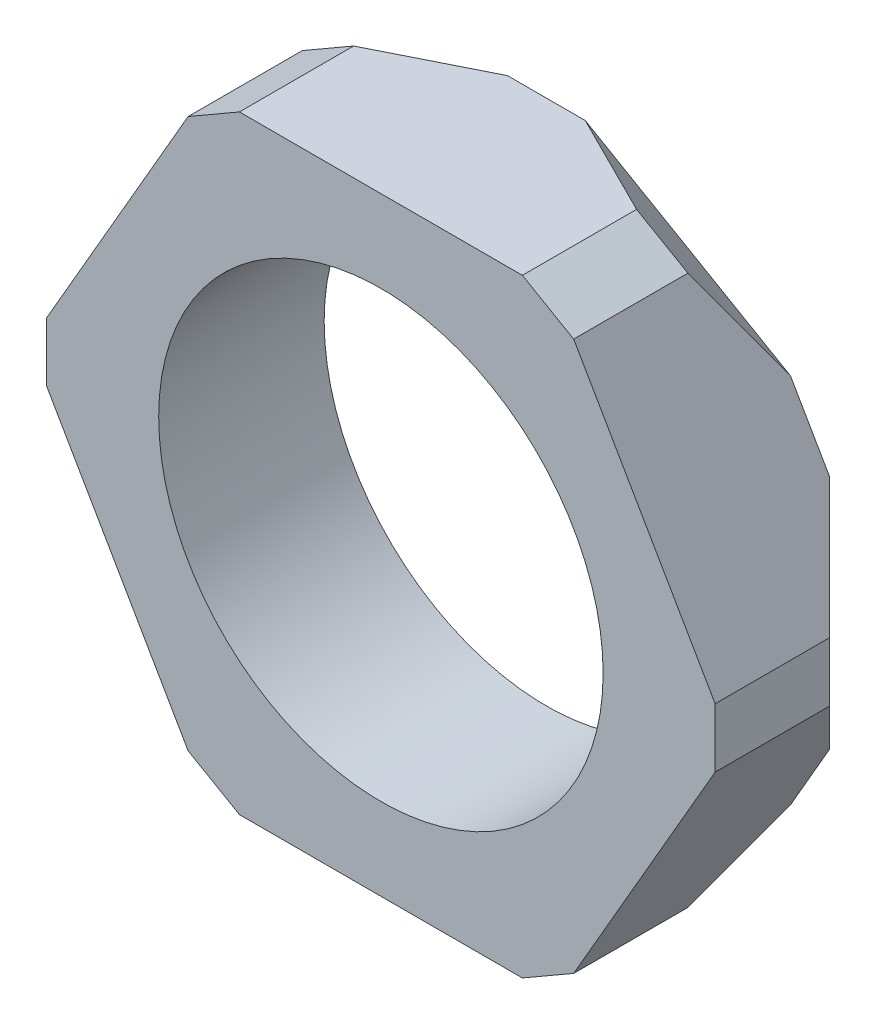
ISO-10303-21;
HEADER;
FILE_DESCRIPTION(('STEP AP214'),'2;1');
FILE_NAME('part.step','',(''),(''),'','','');
FILE_SCHEMA(('AUTOMOTIVE_DESIGN { 1 0 10303 214 1 1 1 1 }'));
ENDSEC;
DATA;
#1=APPLICATION_CONTEXT('core data for automotive mechanical design processes');
#2=APPLICATION_PROTOCOL_DEFINITION('international standard','automotive_design',2000,#1);
#3=PRODUCT_CONTEXT('',#1,'mechanical');
#4=PRODUCT('Part','Part','',(#3));
#5=PRODUCT_RELATED_PRODUCT_CATEGORY('part','',(#4));
#6=PRODUCT_DEFINITION_FORMATION('','',#4);
#7=PRODUCT_DEFINITION_CONTEXT('part definition',#1,'design');
#8=PRODUCT_DEFINITION('design','',#6,#7);
#9=PRODUCT_DEFINITION_SHAPE('','',#8);
#10=(LENGTH_UNIT() NAMED_UNIT(*) SI_UNIT(.MILLI.,.METRE.));
#11=(NAMED_UNIT(*) PLANE_ANGLE_UNIT() SI_UNIT($,.RADIAN.));
#12=(NAMED_UNIT(*) SI_UNIT($,.STERADIAN.) SOLID_ANGLE_UNIT());
#13=UNCERTAINTY_MEASURE_WITH_UNIT(LENGTH_MEASURE(1.E-05),#10,'distance_accuracy_value','');
#14=(GEOMETRIC_REPRESENTATION_CONTEXT(3) GLOBAL_UNCERTAINTY_ASSIGNED_CONTEXT((#13)) GLOBAL_UNIT_ASSIGNED_CONTEXT((#10,
#11,#12)) REPRESENTATION_CONTEXT('',''));
#15=CARTESIAN_POINT('',(0.,0.,0.));
#16=DIRECTION('',(0.,0.,1.));
#17=DIRECTION('',(1.,0.,0.));
#18=AXIS2_PLACEMENT_3D('',#15,#16,#17);
#19=CARTESIAN_POINT('',(0.,0.,4.84));
#20=DIRECTION('',(0.,0.,1.));
#21=DIRECTION('',(1.,0.,0.));
#22=AXIS2_PLACEMENT_3D('',#19,#20,#21);
#23=PLANE('',#22);
#24=DIRECTION('',(1.,0.,0.));
#25=VECTOR('',#24,1.);
#26=CARTESIAN_POINT('',(-5.13841739578752,-8.90000000000013,4.84));
#27=LINE('',#26,#25);
#28=CARTESIAN_POINT('',(-4.1384173957875,-8.90000000000013,4.84));
#29=VERTEX_POINT('',#28);
#30=CARTESIAN_POINT('',(4.13841739578773,-8.90000000000013,4.84));
#31=VERTEX_POINT('',#30);
#32=EDGE_CURVE('E169',#29,#31,#27,.T.);
#33=ORIENTED_EDGE('',*,*,#32,.T.);
#34=DIRECTION('',(-0.866025403784438,-0.5,0.));
#35=VECTOR('',#34,1.);
#36=CARTESIAN_POINT('',(4.88841739578774,-8.46698729810791,4.84));
#37=LINE('',#36,#35);
#38=CARTESIAN_POINT('',(5.63841739578775,-8.03397459621568,4.84));
#39=VERTEX_POINT('',#38);
#40=EDGE_CURVE('E163',#31,#39,#37,.F.);
#41=ORIENTED_EDGE('',*,*,#40,.T.);
#42=DIRECTION('',(0.499999999999999,0.866025403784439,0.));
#43=VECTOR('',#42,1.);
#44=CARTESIAN_POINT('',(5.13841739578774,-8.90000000000013,4.84));
#45=LINE('',#44,#43);
#46=CARTESIAN_POINT('',(9.77683479157543,-0.866025403784524,4.84));
#47=VERTEX_POINT('',#46);
#48=EDGE_CURVE('E166',#39,#47,#45,.T.);
#49=ORIENTED_EDGE('',*,*,#48,.T.);
#50=DIRECTION('',(0.,-1.,0.));
#51=VECTOR('',#50,1.);
#52=CARTESIAN_POINT('',(9.77683479157542,0.,4.84));
#53=LINE('',#52,#51);
#54=CARTESIAN_POINT('',(9.77683479157542,0.866025403784365,4.84));
#55=VERTEX_POINT('',#54);
#56=EDGE_CURVE('E197',#47,#55,#53,.F.);
#57=ORIENTED_EDGE('',*,*,#56,.T.);
#58=DIRECTION('',(-0.5,0.866025403784438,0.));
#59=VECTOR('',#58,1.);
#60=CARTESIAN_POINT('',(10.2768347915754,0.,4.84));
#61=LINE('',#60,#59);
#62=CARTESIAN_POINT('',(5.63841739578772,8.03397459621554,4.84));
#63=VERTEX_POINT('',#62);
#64=EDGE_CURVE('E290',#55,#63,#61,.T.);
#65=ORIENTED_EDGE('',*,*,#64,.T.);
#66=DIRECTION('',(0.866025403784439,-0.5,0.));
#67=VECTOR('',#66,1.);
#68=CARTESIAN_POINT('',(4.88841739578767,8.46698729810779,4.84));
#69=LINE('',#68,#67);
#70=CARTESIAN_POINT('',(4.1384173957877,8.89999999999999,4.84));
#71=VERTEX_POINT('',#70);
#72=EDGE_CURVE('E195',#63,#71,#69,.F.);
#73=ORIENTED_EDGE('',*,*,#72,.T.);
#74=DIRECTION('',(-1.,0.,0.));
#75=VECTOR('',#74,1.);
#76=CARTESIAN_POINT('',(5.13841739578771,8.89999999999999,4.84));
#77=LINE('',#76,#75);
#78=CARTESIAN_POINT('',(-4.13841739578749,8.89999999999999,4.84));
#79=VERTEX_POINT('',#78);
#80=EDGE_CURVE('E292',#71,#79,#77,.T.);
#81=ORIENTED_EDGE('',*,*,#80,.T.);
#82=DIRECTION('',(0.866025403784438,0.500000000000001,0.));
#83=VECTOR('',#82,1.);
#84=CARTESIAN_POINT('',(-4.88841739578762,8.46698729810769,4.84));
#85=LINE('',#84,#83);
#86=CARTESIAN_POINT('',(-5.63841739578749,8.03397459621555,4.84));
#87=VERTEX_POINT('',#86);
#88=EDGE_CURVE('E199',#79,#87,#85,.F.);
#89=ORIENTED_EDGE('',*,*,#88,.T.);
#90=DIRECTION('',(-0.499999999999997,-0.86602540378444,0.));
#91=VECTOR('',#90,1.);
#92=CARTESIAN_POINT('',(-5.13841739578749,8.89999999999999,4.84));
#93=LINE('',#92,#91);
#94=CARTESIAN_POINT('',(-9.77683479157515,0.866025403784389,4.84));
#95=VERTEX_POINT('',#94);
#96=EDGE_CURVE('E295',#87,#95,#93,.T.);
#97=ORIENTED_EDGE('',*,*,#96,.T.);
#98=DIRECTION('',(0.,1.,0.));
#99=VECTOR('',#98,1.);
#100=CARTESIAN_POINT('',(-9.77683479157515,0.,4.84));
#101=LINE('',#100,#99);
#102=CARTESIAN_POINT('',(-9.77683479157515,-0.866025403784505,4.84));
#103=VERTEX_POINT('',#102);
#104=EDGE_CURVE('E201',#95,#103,#101,.F.);
#105=ORIENTED_EDGE('',*,*,#104,.T.);
#106=DIRECTION('',(0.499999999999994,-0.866025403784442,0.));
#107=VECTOR('',#106,1.);
#108=CARTESIAN_POINT('',(-10.2768347915752,0.,4.84));
#109=LINE('',#108,#107);
#110=CARTESIAN_POINT('',(-5.63841739578752,-8.03397459621568,4.84));
#111=VERTEX_POINT('',#110);
#112=EDGE_CURVE('E304',#103,#111,#109,.T.);
#113=ORIENTED_EDGE('',*,*,#112,.T.);
#114=DIRECTION('',(-0.866025403784438,0.500000000000002,0.));
#115=VECTOR('',#114,1.);
#116=CARTESIAN_POINT('',(-4.8884173957877,-8.4669872981078,4.84));
#117=LINE('',#116,#115);
#118=EDGE_CURVE('E174',#111,#29,#117,.F.);
#119=ORIENTED_EDGE('',*,*,#118,.T.);
#120=EDGE_LOOP('',(#33,#41,#49,#57,#65,#73,#81,#89,#97,#105,#113,#119));
#121=FACE_BOUND('',#120,.T.);
#122=CARTESIAN_POINT('',(0.,0.,4.84));
#123=DIRECTION('',(0.,0.,1.));
#124=DIRECTION('',(1.,0.,0.));
#125=AXIS2_PLACEMENT_3D('',#122,#123,#124);
#126=CIRCLE('',#125,6.50000000000001);
#127=CARTESIAN_POINT('',(6.50000000000001,0.,4.84));
#128=VERTEX_POINT('',#127);
#129=EDGE_CURVE('E284',#128,#128,#126,.T.);
#130=ORIENTED_EDGE('',*,*,#129,.F.);
#131=EDGE_LOOP('',(#130));
#132=FACE_BOUND('',#131,.T.);
#133=ADVANCED_FACE('F35',(#121,#132),#23,.T.);
#134=CARTESIAN_POINT('',(0.,0.,0.));
#135=DIRECTION('',(0.,0.,1.));
#136=DIRECTION('',(1.,0.,0.));
#137=AXIS2_PLACEMENT_3D('',#134,#135,#136);
#138=PLANE('',#137);
#139=DIRECTION('',(-0.499999999999997,-0.86602540378444,0.));
#140=VECTOR('',#139,1.);
#141=CARTESIAN_POINT('',(-5.13841739578749,8.89999999999999,0.));
#142=LINE('',#141,#140);
#143=CARTESIAN_POINT('',(-7.13841739578748,5.43589838486224,0.));
#144=VERTEX_POINT('',#143);
#145=CARTESIAN_POINT('',(-8.27683479157514,3.46410161513773,0.));
#146=VERTEX_POINT('',#145);
#147=EDGE_CURVE('E310',#144,#146,#142,.T.);
#148=ORIENTED_EDGE('',*,*,#147,.F.);
#149=DIRECTION('',(0.866025403784438,0.500000000000001,0.));
#150=VECTOR('',#149,1.);
#151=CARTESIAN_POINT('',(-3.38841739578749,7.60096189432333,0.));
#152=LINE('',#151,#150);
#153=CARTESIAN_POINT('',(-1.13841739578749,8.89999999999999,0.));
#154=VERTEX_POINT('',#153);
#155=EDGE_CURVE('E237',#144,#154,#152,.T.);
#156=ORIENTED_EDGE('',*,*,#155,.T.);
#157=DIRECTION('',(-1.,0.,0.));
#158=VECTOR('',#157,1.);
#159=CARTESIAN_POINT('',(5.13841739578771,8.89999999999999,0.));
#160=LINE('',#159,#158);
#161=CARTESIAN_POINT('',(1.13841739578771,8.89999999999999,0.));
#162=VERTEX_POINT('',#161);
#163=EDGE_CURVE('E283',#162,#154,#160,.T.);
#164=ORIENTED_EDGE('',*,*,#163,.F.);
#165=DIRECTION('',(0.866025403784439,-0.5,0.));
#166=VECTOR('',#165,1.);
#167=CARTESIAN_POINT('',(4.88841739578772,6.73493649053889,0.));
#168=LINE('',#167,#166);
#169=CARTESIAN_POINT('',(7.13841739578772,5.43589838486223,0.));
#170=VERTEX_POINT('',#169);
#171=EDGE_CURVE('E222',#162,#170,#168,.T.);
#172=ORIENTED_EDGE('',*,*,#171,.T.);
#173=DIRECTION('',(-0.5,0.866025403784438,0.));
#174=VECTOR('',#173,1.);
#175=CARTESIAN_POINT('',(10.2768347915754,0.,0.));
#176=LINE('',#175,#174);
#177=CARTESIAN_POINT('',(8.27683479157542,3.46410161513768,0.));
#178=VERTEX_POINT('',#177);
#179=EDGE_CURVE('E271',#178,#170,#176,.T.);
#180=ORIENTED_EDGE('',*,*,#179,.F.);
#181=DIRECTION('',(0.,-1.,0.));
#182=VECTOR('',#181,1.);
#183=CARTESIAN_POINT('',(8.27683479157543,-0.866025403784526,0.));
#184=LINE('',#183,#182);
#185=CARTESIAN_POINT('',(8.27683479157543,-3.46410161513784,0.));
#186=VERTEX_POINT('',#185);
#187=EDGE_CURVE('E225',#178,#186,#184,.T.);
#188=ORIENTED_EDGE('',*,*,#187,.T.);
#189=DIRECTION('',(0.499999999999999,0.866025403784439,0.));
#190=VECTOR('',#189,1.);
#191=CARTESIAN_POINT('',(5.13841739578774,-8.90000000000013,0.));
#192=LINE('',#191,#190);
#193=CARTESIAN_POINT('',(7.13841739578774,-5.43589838486237,0.));
#194=VERTEX_POINT('',#193);
#195=EDGE_CURVE('E287',#194,#186,#192,.T.);
#196=ORIENTED_EDGE('',*,*,#195,.F.);
#197=DIRECTION('',(-0.866025403784439,-0.5,0.));
#198=VECTOR('',#197,1.);
#199=CARTESIAN_POINT('',(3.38841739578773,-7.60096189432347,0.));
#200=LINE('',#199,#198);
#201=CARTESIAN_POINT('',(1.13841739578773,-8.90000000000013,0.));
#202=VERTEX_POINT('',#201);
#203=EDGE_CURVE('E228',#194,#202,#200,.T.);
#204=ORIENTED_EDGE('',*,*,#203,.T.);
#205=DIRECTION('',(1.,0.,0.));
#206=VECTOR('',#205,1.);
#207=CARTESIAN_POINT('',(-5.13841739578752,-8.90000000000013,0.));
#208=LINE('',#207,#206);
#209=CARTESIAN_POINT('',(-1.13841739578751,-8.90000000000013,0.));
#210=VERTEX_POINT('',#209);
#211=EDGE_CURVE('E297',#210,#202,#208,.T.);
#212=ORIENTED_EDGE('',*,*,#211,.F.);
#213=DIRECTION('',(-0.866025403784438,0.500000000000002,0.));
#214=VECTOR('',#213,1.);
#215=CARTESIAN_POINT('',(-4.88841739578752,-6.73493649053902,0.));
#216=LINE('',#215,#214);
#217=CARTESIAN_POINT('',(-7.13841739578749,-5.43589838486237,0.));
#218=VERTEX_POINT('',#217);
#219=EDGE_CURVE('E231',#210,#218,#216,.T.);
#220=ORIENTED_EDGE('',*,*,#219,.T.);
#221=DIRECTION('',(0.499999999999994,-0.866025403784442,0.));
#222=VECTOR('',#221,1.);
#223=CARTESIAN_POINT('',(-10.2768347915752,0.,0.));
#224=LINE('',#223,#222);
#225=CARTESIAN_POINT('',(-8.27683479157517,-3.46410161513784,0.));
#226=VERTEX_POINT('',#225);
#227=EDGE_CURVE('E313',#226,#218,#224,.T.);
#228=ORIENTED_EDGE('',*,*,#227,.F.);
#229=DIRECTION('',(0.,1.,0.));
#230=VECTOR('',#229,1.);
#231=CARTESIAN_POINT('',(-8.27683479157515,0.866025403784385,0.));
#232=LINE('',#231,#230);
#233=EDGE_CURVE('E234',#226,#146,#232,.T.);
#234=ORIENTED_EDGE('',*,*,#233,.T.);
#235=EDGE_LOOP('',(#148,#156,#164,#172,#180,#188,#196,#204,#212,#220,#228,#234));
#236=FACE_BOUND('',#235,.T.);
#237=CARTESIAN_POINT('',(0.,0.,0.));
#238=DIRECTION('',(0.,0.,1.));
#239=DIRECTION('',(1.,0.,0.));
#240=AXIS2_PLACEMENT_3D('',#237,#238,#239);
#241=CIRCLE('',#240,6.50000000000001);
#242=CARTESIAN_POINT('',(6.50000000000001,0.,0.));
#243=VERTEX_POINT('',#242);
#244=EDGE_CURVE('E299',#243,#243,#241,.T.);
#245=ORIENTED_EDGE('',*,*,#244,.T.);
#246=EDGE_LOOP('',(#245));
#247=FACE_BOUND('',#246,.T.);
#248=ADVANCED_FACE('F277',(#236,#247),#138,.F.);
#249=CARTESIAN_POINT('',(10.2768347915754,0.,4.84));
#250=DIRECTION('',(-0.866025403784438,-0.5,0.));
#251=DIRECTION('',(0.5,-0.866025403784439,0.));
#252=AXIS2_PLACEMENT_3D('',#249,#250,#251);
#253=PLANE('',#252);
#254=DIRECTION('',(0.,0.,-1.));
#255=VECTOR('',#254,1.);
#256=CARTESIAN_POINT('',(9.77683479157542,0.866025403784366,4.84));
#257=LINE('',#256,#255);
#258=CARTESIAN_POINT('',(9.77683479157542,0.866025403784366,1.5));
#259=VERTEX_POINT('',#258);
#260=EDGE_CURVE('E220',#55,#259,#257,.T.);
#261=ORIENTED_EDGE('',*,*,#260,.T.);
#262=DIRECTION('',(0.447213595499958,-0.774596669241483,0.447213595499959));
#263=VECTOR('',#262,1.);
#264=CARTESIAN_POINT('',(9.4768347915754,1.38564064605508,1.19999999999997));
#265=LINE('',#264,#263);
#266=EDGE_CURVE('E44',#259,#178,#265,.F.);
#267=ORIENTED_EDGE('',*,*,#266,.T.);
#268=ORIENTED_EDGE('',*,*,#179,.T.);
#269=DIRECTION('',(0.447213595499958,-0.774596669241482,-0.44721359549996));
#270=VECTOR('',#269,1.);
#271=CARTESIAN_POINT('',(5.9384173957877,7.51435935394491,1.20000000000002));
#272=LINE('',#271,#270);
#273=CARTESIAN_POINT('',(5.63841739578772,8.03397459621554,1.5));
#274=VERTEX_POINT('',#273);
#275=EDGE_CURVE('E51',#170,#274,#272,.F.);
#276=ORIENTED_EDGE('',*,*,#275,.T.);
#277=DIRECTION('',(0.,0.,1.));
#278=VECTOR('',#277,1.);
#279=CARTESIAN_POINT('',(5.63841739578772,8.03397459621554,4.84));
#280=LINE('',#279,#278);
#281=EDGE_CURVE('E218',#274,#63,#280,.T.);
#282=ORIENTED_EDGE('',*,*,#281,.T.);
#283=ORIENTED_EDGE('',*,*,#64,.F.);
#284=EDGE_LOOP('',(#261,#267,#268,#276,#282,#283));
#285=FACE_BOUND('',#284,.T.);
#286=ADVANCED_FACE('F270',(#285),#253,.F.);
#287=CARTESIAN_POINT('',(5.13841739578771,8.89999999999999,4.84));
#288=DIRECTION('',(0.,-1.,0.));
#289=DIRECTION('',(0.,0.,-1.));
#290=AXIS2_PLACEMENT_3D('',#287,#288,#289);
#291=PLANE('',#290);
#292=ORIENTED_EDGE('',*,*,#163,.T.);
#293=DIRECTION('',(0.894427190999915,0.,-0.44721359549996));
#294=VECTOR('',#293,1.);
#295=CARTESIAN_POINT('',(-3.53841739578759,8.89999999999999,1.20000000000006));
#296=LINE('',#295,#294);
#297=CARTESIAN_POINT('',(-4.13841739578749,8.89999999999999,1.50000000000001));
#298=VERTEX_POINT('',#297);
#299=EDGE_CURVE('E242',#154,#298,#296,.F.);
#300=ORIENTED_EDGE('',*,*,#299,.T.);
#301=DIRECTION('',(0.,0.,1.));
#302=VECTOR('',#301,1.);
#303=CARTESIAN_POINT('',(-4.13841739578749,8.89999999999999,4.84));
#304=LINE('',#303,#302);
#305=EDGE_CURVE('E216',#298,#79,#304,.T.);
#306=ORIENTED_EDGE('',*,*,#305,.T.);
#307=ORIENTED_EDGE('',*,*,#80,.F.);
#308=DIRECTION('',(0.,0.,-1.));
#309=VECTOR('',#308,1.);
#310=CARTESIAN_POINT('',(4.1384173957877,8.89999999999999,4.84));
#311=LINE('',#310,#309);
#312=CARTESIAN_POINT('',(4.1384173957877,8.89999999999999,1.5));
#313=VERTEX_POINT('',#312);
#314=EDGE_CURVE('E213',#71,#313,#311,.T.);
#315=ORIENTED_EDGE('',*,*,#314,.T.);
#316=DIRECTION('',(0.894427190999915,0.,0.44721359549996));
#317=VECTOR('',#316,1.);
#318=CARTESIAN_POINT('',(3.53841739578768,8.89999999999999,1.19999999999999));
#319=LINE('',#318,#317);
#320=EDGE_CURVE('E240',#313,#162,#319,.F.);
#321=ORIENTED_EDGE('',*,*,#320,.T.);
#322=EDGE_LOOP('',(#292,#300,#306,#307,#315,#321));
#323=FACE_BOUND('',#322,.T.);
#324=ADVANCED_FACE('F365',(#323),#291,.F.);
#325=CARTESIAN_POINT('',(-5.13841739578749,8.89999999999999,4.84));
#326=DIRECTION('',(0.86602540378444,-0.499999999999997,0.));
#327=DIRECTION('',(0.499999999999997,0.86602540378444,0.));
#328=AXIS2_PLACEMENT_3D('',#325,#326,#327);
#329=PLANE('',#328);
#330=DIRECTION('',(0.,0.,-1.));
#331=VECTOR('',#330,1.);
#332=CARTESIAN_POINT('',(-5.63841739578749,8.03397459621555,4.84));
#333=LINE('',#332,#331);
#334=CARTESIAN_POINT('',(-5.63841739578749,8.03397459621555,1.50000000000001));
#335=VERTEX_POINT('',#334);
#336=EDGE_CURVE('E208',#87,#335,#333,.T.);
#337=ORIENTED_EDGE('',*,*,#336,.T.);
#338=DIRECTION('',(0.447213595499954,0.774596669241483,0.447213595499962));
#339=VECTOR('',#338,1.);
#340=CARTESIAN_POINT('',(-5.93841739578755,7.51435935394478,1.19999999999995));
#341=LINE('',#340,#339);
#342=EDGE_CURVE('E248',#335,#144,#341,.F.);
#343=ORIENTED_EDGE('',*,*,#342,.T.);
#344=ORIENTED_EDGE('',*,*,#147,.T.);
#345=DIRECTION('',(0.447213595499956,0.774596669241486,-0.447213595499955));
#346=VECTOR('',#345,1.);
#347=CARTESIAN_POINT('',(-9.47683479157513,1.38564064605509,1.19999999999998));
#348=LINE('',#347,#346);
#349=CARTESIAN_POINT('',(-9.77683479157515,0.866025403784389,1.5));
#350=VERTEX_POINT('',#349);
#351=EDGE_CURVE('E246',#146,#350,#348,.F.);
#352=ORIENTED_EDGE('',*,*,#351,.T.);
#353=DIRECTION('',(0.,0.,1.));
#354=VECTOR('',#353,1.);
#355=CARTESIAN_POINT('',(-9.77683479157515,0.866025403784389,4.84));
#356=LINE('',#355,#354);
#357=EDGE_CURVE('E211',#350,#95,#356,.T.);
#358=ORIENTED_EDGE('',*,*,#357,.T.);
#359=ORIENTED_EDGE('',*,*,#96,.F.);
#360=EDGE_LOOP('',(#337,#343,#344,#352,#358,#359));
#361=FACE_BOUND('',#360,.T.);
#362=ADVANCED_FACE('F362',(#361),#329,.F.);
#363=CARTESIAN_POINT('',(-10.2768347915752,0.,4.84));
#364=DIRECTION('',(0.866025403784442,0.499999999999994,0.));
#365=DIRECTION('',(-0.499999999999994,0.866025403784442,0.));
#366=AXIS2_PLACEMENT_3D('',#363,#364,#365);
#367=PLANE('',#366);
#368=DIRECTION('',(0.,0.,-1.));
#369=VECTOR('',#368,1.);
#370=CARTESIAN_POINT('',(-9.77683479157515,-0.866025403784506,4.84));
#371=LINE('',#370,#369);
#372=CARTESIAN_POINT('',(-9.77683479157515,-0.866025403784506,1.5));
#373=VERTEX_POINT('',#372);
#374=EDGE_CURVE('E173',#103,#373,#371,.T.);
#375=ORIENTED_EDGE('',*,*,#374,.T.);
#376=DIRECTION('',(-0.447213595499953,0.774596669241487,0.447213595499957));
#377=VECTOR('',#376,1.);
#378=CARTESIAN_POINT('',(-9.47683479157519,-1.38564064605511,1.20000000000004));
#379=LINE('',#378,#377);
#380=EDGE_CURVE('E254',#373,#226,#379,.F.);
#381=ORIENTED_EDGE('',*,*,#380,.T.);
#382=ORIENTED_EDGE('',*,*,#227,.T.);
#383=DIRECTION('',(-0.447213595499952,0.774596669241485,-0.447213595499962));
#384=VECTOR('',#383,1.);
#385=CARTESIAN_POINT('',(-5.93841739578759,-7.51435935394488,1.19999999999993));
#386=LINE('',#385,#384);
#387=CARTESIAN_POINT('',(-5.63841739578752,-8.03397459621568,1.50000000000001));
#388=VERTEX_POINT('',#387);
#389=EDGE_CURVE('E252',#218,#388,#386,.F.);
#390=ORIENTED_EDGE('',*,*,#389,.T.);
#391=DIRECTION('',(0.,0.,1.));
#392=VECTOR('',#391,1.);
#393=CARTESIAN_POINT('',(-5.63841739578752,-8.03397459621568,4.84));
#394=LINE('',#393,#392);
#395=EDGE_CURVE('E206',#388,#111,#394,.T.);
#396=ORIENTED_EDGE('',*,*,#395,.T.);
#397=ORIENTED_EDGE('',*,*,#112,.F.);
#398=EDGE_LOOP('',(#375,#381,#382,#390,#396,#397));
#399=FACE_BOUND('',#398,.T.);
#400=ADVANCED_FACE('F329',(#399),#367,.F.);
#401=CARTESIAN_POINT('',(-5.13841739578752,-8.90000000000013,4.84));
#402=DIRECTION('',(0.,1.,0.));
#403=DIRECTION('',(0.,0.,1.));
#404=AXIS2_PLACEMENT_3D('',#401,#402,#403);
#405=PLANE('',#404);
#406=DIRECTION('',(0.,0.,-1.));
#407=VECTOR('',#406,1.);
#408=CARTESIAN_POINT('',(-4.1384173957875,-8.90000000000013,4.84));
#409=LINE('',#408,#407);
#410=CARTESIAN_POINT('',(-4.1384173957875,-8.90000000000013,1.50000000000001));
#411=VERTEX_POINT('',#410);
#412=EDGE_CURVE('E186',#29,#411,#409,.T.);
#413=ORIENTED_EDGE('',*,*,#412,.T.);
#414=DIRECTION('',(-0.894427190999915,0.,0.44721359549996));
#415=VECTOR('',#414,1.);
#416=CARTESIAN_POINT('',(-3.53841739578765,-8.90000000000013,1.20000000000008));
#417=LINE('',#416,#415);
#418=EDGE_CURVE('E260',#411,#210,#417,.F.);
#419=ORIENTED_EDGE('',*,*,#418,.T.);
#420=ORIENTED_EDGE('',*,*,#211,.T.);
#421=DIRECTION('',(-0.894427190999915,0.,-0.44721359549996));
#422=VECTOR('',#421,1.);
#423=CARTESIAN_POINT('',(3.53841739578773,-8.90000000000013,1.20000000000001));
#424=LINE('',#423,#422);
#425=CARTESIAN_POINT('',(4.13841739578773,-8.90000000000013,1.50000000000001));
#426=VERTEX_POINT('',#425);
#427=EDGE_CURVE('E258',#202,#426,#424,.F.);
#428=ORIENTED_EDGE('',*,*,#427,.T.);
#429=DIRECTION('',(0.,0.,1.));
#430=VECTOR('',#429,1.);
#431=CARTESIAN_POINT('',(4.13841739578773,-8.90000000000013,4.84));
#432=LINE('',#431,#430);
#433=EDGE_CURVE('E189',#426,#31,#432,.T.);
#434=ORIENTED_EDGE('',*,*,#433,.T.);
#435=ORIENTED_EDGE('',*,*,#32,.F.);
#436=EDGE_LOOP('',(#413,#419,#420,#428,#434,#435));
#437=FACE_BOUND('',#436,.T.);
#438=ADVANCED_FACE('F319',(#437),#405,.F.);
#439=CARTESIAN_POINT('',(5.13841739578774,-8.90000000000013,4.84));
#440=DIRECTION('',(-0.866025403784439,0.499999999999999,0.));
#441=DIRECTION('',(-0.499999999999999,-0.866025403784439,0.));
#442=AXIS2_PLACEMENT_3D('',#439,#440,#441);
#443=PLANE('',#442);
#444=DIRECTION('',(0.,0.,-1.));
#445=VECTOR('',#444,1.);
#446=CARTESIAN_POINT('',(5.63841739578775,-8.03397459621568,4.84));
#447=LINE('',#446,#445);
#448=CARTESIAN_POINT('',(5.63841739578775,-8.03397459621568,1.50000000000001));
#449=VERTEX_POINT('',#448);
#450=EDGE_CURVE('E179',#39,#449,#447,.T.);
#451=ORIENTED_EDGE('',*,*,#450,.T.);
#452=DIRECTION('',(-0.447213595499957,-0.774596669241483,0.44721359549996));
#453=VECTOR('',#452,1.);
#454=CARTESIAN_POINT('',(5.93841739578775,-7.51435935394502,1.2));
#455=LINE('',#454,#453);
#456=EDGE_CURVE('E265',#449,#194,#455,.F.);
#457=ORIENTED_EDGE('',*,*,#456,.T.);
#458=ORIENTED_EDGE('',*,*,#195,.T.);
#459=DIRECTION('',(-0.447213595499957,-0.774596669241483,-0.447213595499959));
#460=VECTOR('',#459,1.);
#461=CARTESIAN_POINT('',(9.47683479157546,-1.38564064605513,1.20000000000004));
#462=LINE('',#461,#460);
#463=CARTESIAN_POINT('',(9.77683479157543,-0.866025403784524,1.5));
#464=VERTEX_POINT('',#463);
#465=EDGE_CURVE('E263',#186,#464,#462,.F.);
#466=ORIENTED_EDGE('',*,*,#465,.T.);
#467=DIRECTION('',(0.,0.,1.));
#468=VECTOR('',#467,1.);
#469=CARTESIAN_POINT('',(9.77683479157543,-0.866025403784524,4.84));
#470=LINE('',#469,#468);
#471=EDGE_CURVE('E181',#464,#47,#470,.T.);
#472=ORIENTED_EDGE('',*,*,#471,.T.);
#473=ORIENTED_EDGE('',*,*,#48,.F.);
#474=EDGE_LOOP('',(#451,#457,#458,#466,#472,#473));
#475=FACE_BOUND('',#474,.T.);
#476=ADVANCED_FACE('F178',(#475),#443,.F.);
#477=CARTESIAN_POINT('',(0.,0.,4.84));
#478=DIRECTION('',(0.,0.,-1.));
#479=DIRECTION('',(-1.,0.,0.));
#480=AXIS2_PLACEMENT_3D('',#477,#478,#479);
#481=CYLINDRICAL_SURFACE('',#480,6.50000000000001);
#482=ORIENTED_EDGE('',*,*,#129,.T.);
#483=EDGE_LOOP('',(#482));
#484=FACE_BOUND('',#483,.T.);
#485=ORIENTED_EDGE('',*,*,#244,.F.);
#486=EDGE_LOOP('',(#485));
#487=FACE_BOUND('',#486,.T.);
#488=ADVANCED_FACE('F354',(#484,#487),#481,.F.);
#489=CARTESIAN_POINT('',(5.63841739578775,-8.03397459621568,4.84));
#490=DIRECTION('',(-0.5,0.866025403784439,0.));
#491=DIRECTION('',(0.,0.,-1.));
#492=AXIS2_PLACEMENT_3D('',#489,#490,#491);
#493=PLANE('',#492);
#494=ORIENTED_EDGE('',*,*,#433,.F.);
#495=DIRECTION('',(-0.866025403784438,-0.5,0.));
#496=VECTOR('',#495,1.);
#497=CARTESIAN_POINT('',(5.63841739578775,-8.03397459621568,1.50000000000001));
#498=LINE('',#497,#496);
#499=EDGE_CURVE('E185',#426,#449,#498,.F.);
#500=ORIENTED_EDGE('',*,*,#499,.T.);
#501=ORIENTED_EDGE('',*,*,#450,.F.);
#502=ORIENTED_EDGE('',*,*,#40,.F.);
#503=EDGE_LOOP('',(#494,#500,#501,#502));
#504=FACE_BOUND('',#503,.T.);
#505=ADVANCED_FACE('F183',(#504),#493,.F.);
#506=CARTESIAN_POINT('',(-4.1384173957875,-8.90000000000013,4.84));
#507=DIRECTION('',(0.500000000000002,0.866025403784438,0.));
#508=DIRECTION('',(0.,0.,-1.));
#509=AXIS2_PLACEMENT_3D('',#506,#507,#508);
#510=PLANE('',#509);
#511=ORIENTED_EDGE('',*,*,#395,.F.);
#512=DIRECTION('',(-0.866025403784438,0.500000000000002,0.));
#513=VECTOR('',#512,1.);
#514=CARTESIAN_POINT('',(-4.1384173957875,-8.90000000000013,1.50000000000001));
#515=LINE('',#514,#513);
#516=EDGE_CURVE('E256',#388,#411,#515,.F.);
#517=ORIENTED_EDGE('',*,*,#516,.T.);
#518=ORIENTED_EDGE('',*,*,#412,.F.);
#519=ORIENTED_EDGE('',*,*,#118,.F.);
#520=EDGE_LOOP('',(#511,#517,#518,#519));
#521=FACE_BOUND('',#520,.T.);
#522=ADVANCED_FACE('F333',(#521),#510,.F.);
#523=CARTESIAN_POINT('',(-9.77683479157515,-0.866025403784507,4.84));
#524=DIRECTION('',(1.,0.,0.));
#525=DIRECTION('',(0.,0.,-1.));
#526=AXIS2_PLACEMENT_3D('',#523,#524,#525);
#527=PLANE('',#526);
#528=ORIENTED_EDGE('',*,*,#357,.F.);
#529=DIRECTION('',(0.,1.,0.));
#530=VECTOR('',#529,1.);
#531=CARTESIAN_POINT('',(-9.77683479157515,-0.866025403784505,1.50000000000001));
#532=LINE('',#531,#530);
#533=EDGE_CURVE('E250',#350,#373,#532,.F.);
#534=ORIENTED_EDGE('',*,*,#533,.T.);
#535=ORIENTED_EDGE('',*,*,#374,.F.);
#536=ORIENTED_EDGE('',*,*,#104,.F.);
#537=EDGE_LOOP('',(#528,#534,#535,#536));
#538=FACE_BOUND('',#537,.T.);
#539=ADVANCED_FACE('F383',(#538),#527,.F.);
#540=CARTESIAN_POINT('',(-5.63841739578749,8.03397459621555,4.84));
#541=DIRECTION('',(0.5,-0.866025403784438,0.));
#542=DIRECTION('',(0.,0.,-1.));
#543=AXIS2_PLACEMENT_3D('',#540,#541,#542);
#544=PLANE('',#543);
#545=ORIENTED_EDGE('',*,*,#305,.F.);
#546=DIRECTION('',(0.866025403784438,0.500000000000001,0.));
#547=VECTOR('',#546,1.);
#548=CARTESIAN_POINT('',(-5.63841739578749,8.03397459621555,1.50000000000001));
#549=LINE('',#548,#547);
#550=EDGE_CURVE('E244',#298,#335,#549,.F.);
#551=ORIENTED_EDGE('',*,*,#550,.T.);
#552=ORIENTED_EDGE('',*,*,#336,.F.);
#553=ORIENTED_EDGE('',*,*,#88,.F.);
#554=EDGE_LOOP('',(#545,#551,#552,#553));
#555=FACE_BOUND('',#554,.T.);
#556=ADVANCED_FACE('F389',(#555),#544,.F.);
#557=CARTESIAN_POINT('',(9.77683479157542,0.866025403784364,4.84));
#558=DIRECTION('',(-1.,0.,0.));
#559=DIRECTION('',(0.,0.,-1.));
#560=AXIS2_PLACEMENT_3D('',#557,#558,#559);
#561=PLANE('',#560);
#562=ORIENTED_EDGE('',*,*,#471,.F.);
#563=DIRECTION('',(0.,-1.,0.));
#564=VECTOR('',#563,1.);
#565=CARTESIAN_POINT('',(9.77683479157542,0.866025403784365,1.50000000000001));
#566=LINE('',#565,#564);
#567=EDGE_CURVE('E59',#464,#259,#566,.F.);
#568=ORIENTED_EDGE('',*,*,#567,.T.);
#569=ORIENTED_EDGE('',*,*,#260,.F.);
#570=ORIENTED_EDGE('',*,*,#56,.F.);
#571=EDGE_LOOP('',(#562,#568,#569,#570));
#572=FACE_BOUND('',#571,.T.);
#573=ADVANCED_FACE('F288',(#572),#561,.F.);
#574=CARTESIAN_POINT('',(4.1384173957877,8.89999999999999,4.84));
#575=DIRECTION('',(-0.5,-0.866025403784439,0.));
#576=DIRECTION('',(0.,0.,-1.));
#577=AXIS2_PLACEMENT_3D('',#574,#575,#576);
#578=PLANE('',#577);
#579=ORIENTED_EDGE('',*,*,#281,.F.);
#580=DIRECTION('',(0.866025403784439,-0.5,0.));
#581=VECTOR('',#580,1.);
#582=CARTESIAN_POINT('',(4.1384173957877,8.89999999999999,1.50000000000001));
#583=LINE('',#582,#581);
#584=EDGE_CURVE('E11',#274,#313,#583,.F.);
#585=ORIENTED_EDGE('',*,*,#584,.T.);
#586=ORIENTED_EDGE('',*,*,#314,.F.);
#587=ORIENTED_EDGE('',*,*,#72,.F.);
#588=EDGE_LOOP('',(#579,#585,#586,#587));
#589=FACE_BOUND('',#588,.T.);
#590=ADVANCED_FACE('F402',(#589),#578,.F.);
#591=CARTESIAN_POINT('',(-4.13841739578762,7.16794919243103,0.));
#592=DIRECTION('',(0.353553390593275,-0.612372435695796,0.707106781186545));
#593=DIRECTION('',(0.866025403784438,0.500000000000001,0.));
#594=AXIS2_PLACEMENT_3D('',#591,#592,#593);
#595=PLANE('',#594);
#596=ORIENTED_EDGE('',*,*,#342,.F.);
#597=ORIENTED_EDGE('',*,*,#550,.F.);
#598=ORIENTED_EDGE('',*,*,#299,.F.);
#599=ORIENTED_EDGE('',*,*,#155,.F.);
#600=EDGE_LOOP('',(#596,#597,#598,#599));
#601=FACE_BOUND('',#600,.T.);
#602=ADVANCED_FACE('F408',(#601),#595,.F.);
#603=CARTESIAN_POINT('',(-8.27683479157515,0.,0.));
#604=DIRECTION('',(0.707106781186549,0.,0.707106781186546));
#605=DIRECTION('',(0.,1.,0.));
#606=AXIS2_PLACEMENT_3D('',#603,#604,#605);
#607=PLANE('',#606);
#608=ORIENTED_EDGE('',*,*,#380,.F.);
#609=ORIENTED_EDGE('',*,*,#533,.F.);
#610=ORIENTED_EDGE('',*,*,#351,.F.);
#611=ORIENTED_EDGE('',*,*,#233,.F.);
#612=EDGE_LOOP('',(#608,#609,#610,#611));
#613=FACE_BOUND('',#612,.T.);
#614=ADVANCED_FACE('F343',(#613),#607,.F.);
#615=CARTESIAN_POINT('',(-4.1384173957877,-7.16794919243114,0.));
#616=DIRECTION('',(0.353553390593276,0.612372435695795,0.707106781186546));
#617=DIRECTION('',(-0.866025403784438,0.500000000000002,0.));
#618=AXIS2_PLACEMENT_3D('',#615,#616,#617);
#619=PLANE('',#618);
#620=ORIENTED_EDGE('',*,*,#418,.F.);
#621=ORIENTED_EDGE('',*,*,#516,.F.);
#622=ORIENTED_EDGE('',*,*,#389,.F.);
#623=ORIENTED_EDGE('',*,*,#219,.F.);
#624=EDGE_LOOP('',(#620,#621,#622,#623));
#625=FACE_BOUND('',#624,.T.);
#626=ADVANCED_FACE('F325',(#625),#619,.F.);
#627=CARTESIAN_POINT('',(4.13841739578774,-7.16794919243125,0.));
#628=DIRECTION('',(-0.353553390593275,0.612372435695796,0.707106781186546));
#629=DIRECTION('',(-0.866025403784438,-0.5,0.));
#630=AXIS2_PLACEMENT_3D('',#627,#628,#629);
#631=PLANE('',#630);
#632=ORIENTED_EDGE('',*,*,#456,.F.);
#633=ORIENTED_EDGE('',*,*,#499,.F.);
#634=ORIENTED_EDGE('',*,*,#427,.F.);
#635=ORIENTED_EDGE('',*,*,#203,.F.);
#636=EDGE_LOOP('',(#632,#633,#634,#635));
#637=FACE_BOUND('',#636,.T.);
#638=ADVANCED_FACE('F336',(#637),#631,.F.);
#639=CARTESIAN_POINT('',(8.27683479157543,0.,0.));
#640=DIRECTION('',(-0.707106781186549,0.,0.707106781186546));
#641=DIRECTION('',(0.,-1.,0.));
#642=AXIS2_PLACEMENT_3D('',#639,#640,#641);
#643=PLANE('',#642);
#644=ORIENTED_EDGE('',*,*,#266,.F.);
#645=ORIENTED_EDGE('',*,*,#567,.F.);
#646=ORIENTED_EDGE('',*,*,#465,.F.);
#647=ORIENTED_EDGE('',*,*,#187,.F.);
#648=EDGE_LOOP('',(#644,#645,#646,#647));
#649=FACE_BOUND('',#648,.T.);
#650=ADVANCED_FACE('F286',(#649),#643,.F.);
#651=CARTESIAN_POINT('',(4.13841739578768,7.16794919243114,0.));
#652=DIRECTION('',(-0.353553390593275,-0.612372435695796,0.707106781186545));
#653=DIRECTION('',(0.866025403784439,-0.5,0.));
#654=AXIS2_PLACEMENT_3D('',#651,#652,#653);
#655=PLANE('',#654);
#656=ORIENTED_EDGE('',*,*,#320,.F.);
#657=ORIENTED_EDGE('',*,*,#584,.F.);
#658=ORIENTED_EDGE('',*,*,#275,.F.);
#659=ORIENTED_EDGE('',*,*,#171,.F.);
#660=EDGE_LOOP('',(#656,#657,#658,#659));
#661=FACE_BOUND('',#660,.T.);
#662=ADVANCED_FACE('F38',(#661),#655,.F.);
#663=CLOSED_SHELL('',(#133,#248,#286,#324,#362,#400,#438,#476,#488,#505,#522,#539,#556,#573,
#590,#602,#614,#626,#638,#650,#662));
#664=MANIFOLD_SOLID_BREP('B2',#663);
#665=ADVANCED_BREP_SHAPE_REPRESENTATION('',(#18,#664),#14);
#666=SHAPE_DEFINITION_REPRESENTATION(#9,#665);
ENDSEC;
END-ISO-10303-21;
